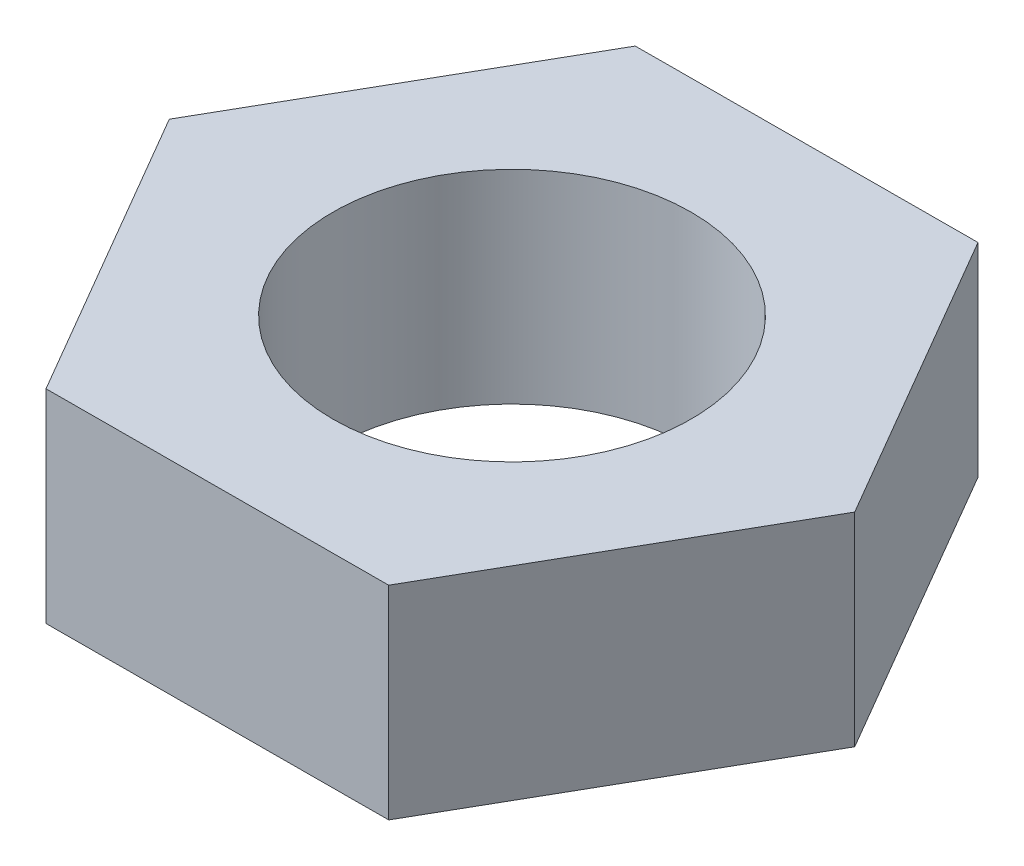
ISO-10303-21;
HEADER;
FILE_DESCRIPTION(('STEP AP214'),'2;1');
FILE_NAME('part.step','',(''),(''),'','','');
FILE_SCHEMA(('AUTOMOTIVE_DESIGN { 1 0 10303 214 1 1 1 1 }'));
ENDSEC;
DATA;
#1=APPLICATION_CONTEXT('core data for automotive mechanical design processes');
#2=APPLICATION_PROTOCOL_DEFINITION('international standard','automotive_design',2000,#1);
#3=PRODUCT_CONTEXT('',#1,'mechanical');
#4=PRODUCT('Part','Part','',(#3));
#5=PRODUCT_RELATED_PRODUCT_CATEGORY('part','',(#4));
#6=PRODUCT_DEFINITION_FORMATION('','',#4);
#7=PRODUCT_DEFINITION_CONTEXT('part definition',#1,'design');
#8=PRODUCT_DEFINITION('design','',#6,#7);
#9=PRODUCT_DEFINITION_SHAPE('','',#8);
#10=(LENGTH_UNIT() NAMED_UNIT(*) SI_UNIT(.MILLI.,.METRE.));
#11=(NAMED_UNIT(*) PLANE_ANGLE_UNIT() SI_UNIT($,.RADIAN.));
#12=(NAMED_UNIT(*) SI_UNIT($,.STERADIAN.) SOLID_ANGLE_UNIT());
#13=UNCERTAINTY_MEASURE_WITH_UNIT(LENGTH_MEASURE(1.E-05),#10,'distance_accuracy_value','');
#14=(GEOMETRIC_REPRESENTATION_CONTEXT(3) GLOBAL_UNCERTAINTY_ASSIGNED_CONTEXT((#13)) GLOBAL_UNIT_ASSIGNED_CONTEXT((#10,
#11,#12)) REPRESENTATION_CONTEXT('',''));
#15=CARTESIAN_POINT('',(0.,0.,0.));
#16=DIRECTION('',(0.,0.,1.));
#17=DIRECTION('',(1.,0.,0.));
#18=AXIS2_PLACEMENT_3D('',#15,#16,#17);
#19=CARTESIAN_POINT('',(15.48581609446,9.22,-0.0566904627170724));
#20=DIRECTION('',(-0.864189213523948,0.,0.503166973507662));
#21=DIRECTION('',(0.503166973507662,0.,0.864189213523948));
#22=AXIS2_PLACEMENT_3D('',#19,#20,#21);
#23=PLANE('',#22);
#24=DIRECTION('',(-0.503166973507662,0.,-0.864189213523948));
#25=VECTOR('',#24,1.);
#26=CARTESIAN_POINT('',(15.48581609446,0.,-0.0566904627170724));
#27=LINE('',#26,#25);
#28=CARTESIAN_POINT('',(15.48581609446,0.,-0.0566904627170724));
#29=VERTEX_POINT('',#28);
#30=CARTESIAN_POINT('',(7.69381266636473,0.,-13.4394553674948));
#31=VERTEX_POINT('',#30);
#32=EDGE_CURVE('E132',#29,#31,#27,.T.);
#33=ORIENTED_EDGE('',*,*,#32,.T.);
#34=DIRECTION('',(0.,-1.,0.));
#35=VECTOR('',#34,1.);
#36=CARTESIAN_POINT('',(7.69381266636473,9.22,-13.4394553674948));
#37=LINE('',#36,#35);
#38=CARTESIAN_POINT('',(7.69381266636473,9.22,-13.4394553674948));
#39=VERTEX_POINT('',#38);
#40=EDGE_CURVE('E11',#39,#31,#37,.T.);
#41=ORIENTED_EDGE('',*,*,#40,.F.);
#42=DIRECTION('',(-0.503166973507662,0.,-0.864189213523948));
#43=VECTOR('',#42,1.);
#44=CARTESIAN_POINT('',(15.48581609446,9.22,-0.0566904627170724));
#45=LINE('',#44,#43);
#46=CARTESIAN_POINT('',(15.48581609446,9.22,-0.0566904627170724));
#47=VERTEX_POINT('',#46);
#48=EDGE_CURVE('E149',#47,#39,#45,.T.);
#49=ORIENTED_EDGE('',*,*,#48,.F.);
#50=DIRECTION('',(0.,-1.,0.));
#51=VECTOR('',#50,1.);
#52=CARTESIAN_POINT('',(15.48581609446,9.22,-0.0566904627170724));
#53=LINE('',#52,#51);
#54=EDGE_CURVE('E128',#47,#29,#53,.T.);
#55=ORIENTED_EDGE('',*,*,#54,.T.);
#56=EDGE_LOOP('',(#33,#41,#49,#55));
#57=FACE_BOUND('',#56,.T.);
#58=ADVANCED_FACE('F43',(#57),#23,.F.);
#59=CARTESIAN_POINT('',(7.69381266636473,9.22,-13.4394553674948));
#60=DIRECTION('',(0.00366077464099213,0.,0.999993299342064));
#61=DIRECTION('',(0.999993299342064,0.,-0.00366077464099213));
#62=AXIS2_PLACEMENT_3D('',#59,#60,#61);
#63=PLANE('',#62);
#64=DIRECTION('',(-0.999993299342064,0.,0.00366077464099213));
#65=VECTOR('',#64,1.);
#66=CARTESIAN_POINT('',(7.69381266636473,0.,-13.4394553674948));
#67=LINE('',#66,#65);
#68=CARTESIAN_POINT('',(-7.79200342809529,0.,-13.3827649047778));
#69=VERTEX_POINT('',#68);
#70=EDGE_CURVE('E136',#31,#69,#67,.T.);
#71=ORIENTED_EDGE('',*,*,#70,.T.);
#72=DIRECTION('',(0.,-1.,0.));
#73=VECTOR('',#72,1.);
#74=CARTESIAN_POINT('',(-7.79200342809529,9.22,-13.3827649047778));
#75=LINE('',#74,#73);
#76=CARTESIAN_POINT('',(-7.79200342809529,9.22,-13.3827649047778));
#77=VERTEX_POINT('',#76);
#78=EDGE_CURVE('E52',#77,#69,#75,.T.);
#79=ORIENTED_EDGE('',*,*,#78,.F.);
#80=DIRECTION('',(-0.999993299342064,0.,0.00366077464099213));
#81=VECTOR('',#80,1.);
#82=CARTESIAN_POINT('',(7.69381266636473,9.22,-13.4394553674948));
#83=LINE('',#82,#81);
#84=EDGE_CURVE('E97',#39,#77,#83,.T.);
#85=ORIENTED_EDGE('',*,*,#84,.F.);
#86=ORIENTED_EDGE('',*,*,#40,.T.);
#87=EDGE_LOOP('',(#71,#79,#85,#86));
#88=FACE_BOUND('',#87,.T.);
#89=ADVANCED_FACE('F178',(#88),#63,.F.);
#90=CARTESIAN_POINT('',(-7.79200342809529,9.22,-13.3827649047778));
#91=DIRECTION('',(0.867849988164941,0.,0.496826325834403));
#92=DIRECTION('',(0.496826325834403,0.,-0.867849988164941));
#93=AXIS2_PLACEMENT_3D('',#90,#91,#92);
#94=PLANE('',#93);
#95=DIRECTION('',(-0.496826325834403,0.,0.867849988164941));
#96=VECTOR('',#95,1.);
#97=CARTESIAN_POINT('',(-7.79200342809529,0.,-13.3827649047778));
#98=LINE('',#97,#96);
#99=CARTESIAN_POINT('',(-15.48581609446,0.,0.0566904627170724));
#100=VERTEX_POINT('',#99);
#101=EDGE_CURVE('E140',#69,#100,#98,.T.);
#102=ORIENTED_EDGE('',*,*,#101,.T.);
#103=DIRECTION('',(0.,-1.,0.));
#104=VECTOR('',#103,1.);
#105=CARTESIAN_POINT('',(-15.48581609446,9.22,0.0566904627170724));
#106=LINE('',#105,#104);
#107=CARTESIAN_POINT('',(-15.48581609446,9.22,0.0566904627170724));
#108=VERTEX_POINT('',#107);
#109=EDGE_CURVE('E121',#108,#100,#106,.T.);
#110=ORIENTED_EDGE('',*,*,#109,.F.);
#111=DIRECTION('',(-0.496826325834403,0.,0.867849988164941));
#112=VECTOR('',#111,1.);
#113=CARTESIAN_POINT('',(-7.79200342809529,9.22,-13.3827649047778));
#114=LINE('',#113,#112);
#115=EDGE_CURVE('E110',#77,#108,#114,.T.);
#116=ORIENTED_EDGE('',*,*,#115,.F.);
#117=ORIENTED_EDGE('',*,*,#78,.T.);
#118=EDGE_LOOP('',(#102,#110,#116,#117));
#119=FACE_BOUND('',#118,.T.);
#120=ADVANCED_FACE('F159',(#119),#94,.F.);
#121=CARTESIAN_POINT('',(-15.48581609446,9.22,0.0566904627170724));
#122=DIRECTION('',(0.864189213523948,0.,-0.503166973507662));
#123=DIRECTION('',(-0.503166973507662,0.,-0.864189213523948));
#124=AXIS2_PLACEMENT_3D('',#121,#122,#123);
#125=PLANE('',#124);
#126=DIRECTION('',(0.503166973507662,0.,0.864189213523948));
#127=VECTOR('',#126,1.);
#128=CARTESIAN_POINT('',(-15.48581609446,0.,0.0566904627170724));
#129=LINE('',#128,#127);
#130=CARTESIAN_POINT('',(-7.69381266636472,0.,13.4394553674948));
#131=VERTEX_POINT('',#130);
#132=EDGE_CURVE('E119',#100,#131,#129,.T.);
#133=ORIENTED_EDGE('',*,*,#132,.T.);
#134=DIRECTION('',(0.,-1.,0.));
#135=VECTOR('',#134,1.);
#136=CARTESIAN_POINT('',(-7.69381266636472,9.22,13.4394553674948));
#137=LINE('',#136,#135);
#138=CARTESIAN_POINT('',(-7.69381266636472,9.22,13.4394553674948));
#139=VERTEX_POINT('',#138);
#140=EDGE_CURVE('E116',#139,#131,#137,.T.);
#141=ORIENTED_EDGE('',*,*,#140,.F.);
#142=DIRECTION('',(0.503166973507662,0.,0.864189213523948));
#143=VECTOR('',#142,1.);
#144=CARTESIAN_POINT('',(-15.48581609446,9.22,0.0566904627170724));
#145=LINE('',#144,#143);
#146=EDGE_CURVE('E104',#108,#139,#145,.T.);
#147=ORIENTED_EDGE('',*,*,#146,.F.);
#148=ORIENTED_EDGE('',*,*,#109,.T.);
#149=EDGE_LOOP('',(#133,#141,#147,#148));
#150=FACE_BOUND('',#149,.T.);
#151=ADVANCED_FACE('F117',(#150),#125,.F.);
#152=CARTESIAN_POINT('',(-7.69381266636472,9.22,13.4394553674948));
#153=DIRECTION('',(-0.00366077464099191,0.,-0.999993299342065));
#154=DIRECTION('',(-0.999993299342065,0.,0.00366077464099191));
#155=AXIS2_PLACEMENT_3D('',#152,#153,#154);
#156=PLANE('',#155);
#157=DIRECTION('',(0.999993299342065,0.,-0.00366077464099191));
#158=VECTOR('',#157,1.);
#159=CARTESIAN_POINT('',(-7.69381266636472,0.,13.4394553674948));
#160=LINE('',#159,#158);
#161=CARTESIAN_POINT('',(7.79200342809529,0.,13.3827649047778));
#162=VERTEX_POINT('',#161);
#163=EDGE_CURVE('E83',#131,#162,#160,.T.);
#164=ORIENTED_EDGE('',*,*,#163,.T.);
#165=DIRECTION('',(0.,-1.,0.));
#166=VECTOR('',#165,1.);
#167=CARTESIAN_POINT('',(7.79200342809529,9.22,13.3827649047778));
#168=LINE('',#167,#166);
#169=CARTESIAN_POINT('',(7.79200342809529,9.22,13.3827649047778));
#170=VERTEX_POINT('',#169);
#171=EDGE_CURVE('E122',#170,#162,#168,.T.);
#172=ORIENTED_EDGE('',*,*,#171,.F.);
#173=DIRECTION('',(0.999993299342065,0.,-0.00366077464099191));
#174=VECTOR('',#173,1.);
#175=CARTESIAN_POINT('',(-7.69381266636472,9.22,13.4394553674948));
#176=LINE('',#175,#174);
#177=EDGE_CURVE('E108',#139,#170,#176,.T.);
#178=ORIENTED_EDGE('',*,*,#177,.F.);
#179=ORIENTED_EDGE('',*,*,#140,.T.);
#180=EDGE_LOOP('',(#164,#172,#178,#179));
#181=FACE_BOUND('',#180,.T.);
#182=ADVANCED_FACE('F124',(#181),#156,.F.);
#183=CARTESIAN_POINT('',(7.79200342809529,9.22,13.3827649047778));
#184=DIRECTION('',(-0.867849988164941,0.,-0.496826325834403));
#185=DIRECTION('',(-0.496826325834403,0.,0.867849988164941));
#186=AXIS2_PLACEMENT_3D('',#183,#184,#185);
#187=PLANE('',#186);
#188=DIRECTION('',(0.496826325834403,0.,-0.867849988164941));
#189=VECTOR('',#188,1.);
#190=CARTESIAN_POINT('',(7.79200342809529,0.,13.3827649047778));
#191=LINE('',#190,#189);
#192=EDGE_CURVE('E89',#162,#29,#191,.T.);
#193=ORIENTED_EDGE('',*,*,#192,.T.);
#194=ORIENTED_EDGE('',*,*,#54,.F.);
#195=DIRECTION('',(0.496826325834403,0.,-0.867849988164941));
#196=VECTOR('',#195,1.);
#197=CARTESIAN_POINT('',(7.79200342809529,9.22,13.3827649047778));
#198=LINE('',#197,#196);
#199=EDGE_CURVE('E60',#170,#47,#198,.T.);
#200=ORIENTED_EDGE('',*,*,#199,.F.);
#201=ORIENTED_EDGE('',*,*,#171,.T.);
#202=EDGE_LOOP('',(#193,#194,#200,#201));
#203=FACE_BOUND('',#202,.T.);
#204=ADVANCED_FACE('F166',(#203),#187,.F.);
#205=CARTESIAN_POINT('',(0.,9.22,0.));
#206=DIRECTION('',(0.,1.,0.));
#207=DIRECTION('',(0.,0.,1.));
#208=AXIS2_PLACEMENT_3D('',#205,#206,#207);
#209=PLANE('',#208);
#210=CARTESIAN_POINT('',(0.,9.22,0.));
#211=DIRECTION('',(0.,1.,0.));
#212=DIRECTION('',(0.,0.,1.));
#213=AXIS2_PLACEMENT_3D('',#210,#211,#212);
#214=CIRCLE('',#213,8.128);
#215=CARTESIAN_POINT('',(0.,9.22,8.128));
#216=VERTEX_POINT('',#215);
#217=EDGE_CURVE('E265',#216,#216,#214,.T.);
#218=ORIENTED_EDGE('',*,*,#217,.F.);
#219=EDGE_LOOP('',(#218));
#220=FACE_BOUND('',#219,.T.);
#221=ORIENTED_EDGE('',*,*,#48,.T.);
#222=ORIENTED_EDGE('',*,*,#84,.T.);
#223=ORIENTED_EDGE('',*,*,#115,.T.);
#224=ORIENTED_EDGE('',*,*,#146,.T.);
#225=ORIENTED_EDGE('',*,*,#177,.T.);
#226=ORIENTED_EDGE('',*,*,#199,.T.);
#227=EDGE_LOOP('',(#221,#222,#223,#224,#225,#226));
#228=FACE_BOUND('',#227,.T.);
#229=ADVANCED_FACE('F106',(#220,#228),#209,.T.);
#230=CARTESIAN_POINT('',(0.,0.,0.));
#231=DIRECTION('',(0.,1.,0.));
#232=DIRECTION('',(0.,0.,1.));
#233=AXIS2_PLACEMENT_3D('',#230,#231,#232);
#234=PLANE('',#233);
#235=CARTESIAN_POINT('',(0.,0.,0.));
#236=DIRECTION('',(0.,1.,0.));
#237=DIRECTION('',(0.,0.,1.));
#238=AXIS2_PLACEMENT_3D('',#235,#236,#237);
#239=CIRCLE('',#238,8.128);
#240=CARTESIAN_POINT('',(0.,0.,8.128));
#241=VERTEX_POINT('',#240);
#242=EDGE_CURVE('E137',#241,#241,#239,.T.);
#243=ORIENTED_EDGE('',*,*,#242,.T.);
#244=EDGE_LOOP('',(#243));
#245=FACE_BOUND('',#244,.T.);
#246=ORIENTED_EDGE('',*,*,#32,.F.);
#247=ORIENTED_EDGE('',*,*,#192,.F.);
#248=ORIENTED_EDGE('',*,*,#163,.F.);
#249=ORIENTED_EDGE('',*,*,#132,.F.);
#250=ORIENTED_EDGE('',*,*,#101,.F.);
#251=ORIENTED_EDGE('',*,*,#70,.F.);
#252=EDGE_LOOP('',(#246,#247,#248,#249,#250,#251));
#253=FACE_BOUND('',#252,.T.);
#254=ADVANCED_FACE('F162',(#245,#253),#234,.F.);
#255=CARTESIAN_POINT('',(0.,0.,0.));
#256=DIRECTION('',(0.,1.,0.));
#257=DIRECTION('',(0.,0.,1.));
#258=AXIS2_PLACEMENT_3D('',#255,#256,#257);
#259=CYLINDRICAL_SURFACE('',#258,8.128);
#260=ORIENTED_EDGE('',*,*,#242,.F.);
#261=EDGE_LOOP('',(#260));
#262=FACE_BOUND('',#261,.T.);
#263=ORIENTED_EDGE('',*,*,#217,.T.);
#264=EDGE_LOOP('',(#263));
#265=FACE_BOUND('',#264,.T.);
#266=ADVANCED_FACE('F218',(#262,#265),#259,.F.);
#267=CLOSED_SHELL('',(#58,#89,#120,#151,#182,#204,#229,#254,#266));
#268=MANIFOLD_SOLID_BREP('B2',#267);
#269=ADVANCED_BREP_SHAPE_REPRESENTATION('',(#18,#268),#14);
#270=SHAPE_DEFINITION_REPRESENTATION(#9,#269);
ENDSEC;
END-ISO-10303-21;
